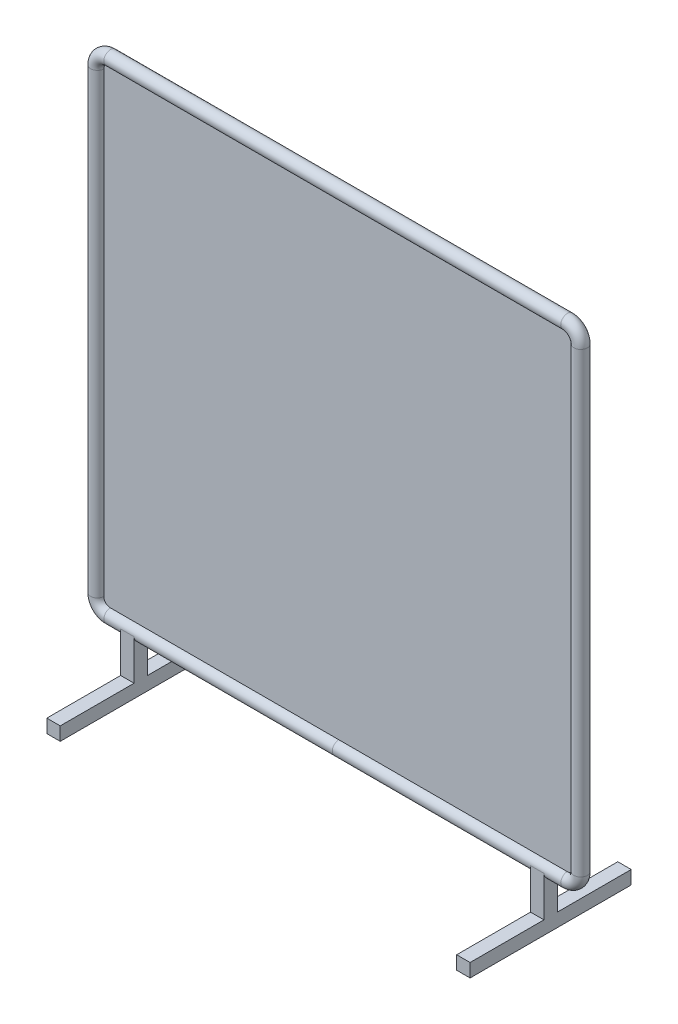
ISO-10303-21;
HEADER;
FILE_DESCRIPTION(('STEP AP214'),'2;1');
FILE_NAME('part.step','',(''),(''),'','','');
FILE_SCHEMA(('AUTOMOTIVE_DESIGN { 1 0 10303 214 1 1 1 1 }'));
ENDSEC;
DATA;
#1=APPLICATION_CONTEXT('core data for automotive mechanical design processes');
#2=APPLICATION_PROTOCOL_DEFINITION('international standard','automotive_design',2000,#1);
#3=PRODUCT_CONTEXT('',#1,'mechanical');
#4=PRODUCT('Part','Part','',(#3));
#5=PRODUCT_RELATED_PRODUCT_CATEGORY('part','',(#4));
#6=PRODUCT_DEFINITION_FORMATION('','',#4);
#7=PRODUCT_DEFINITION_CONTEXT('part definition',#1,'design');
#8=PRODUCT_DEFINITION('design','',#6,#7);
#9=PRODUCT_DEFINITION_SHAPE('','',#8);
#10=(LENGTH_UNIT() NAMED_UNIT(*) SI_UNIT(.MILLI.,.METRE.));
#11=(NAMED_UNIT(*) PLANE_ANGLE_UNIT() SI_UNIT($,.RADIAN.));
#12=(NAMED_UNIT(*) SI_UNIT($,.STERADIAN.) SOLID_ANGLE_UNIT());
#13=UNCERTAINTY_MEASURE_WITH_UNIT(LENGTH_MEASURE(1.E-05),#10,'distance_accuracy_value','');
#14=(GEOMETRIC_REPRESENTATION_CONTEXT(3) GLOBAL_UNCERTAINTY_ASSIGNED_CONTEXT((#13)) GLOBAL_UNIT_ASSIGNED_CONTEXT((#10,
#11,#12)) REPRESENTATION_CONTEXT('',''));
#15=CARTESIAN_POINT('',(0.,0.,0.));
#16=DIRECTION('',(0.,0.,1.));
#17=DIRECTION('',(1.,0.,0.));
#18=AXIS2_PLACEMENT_3D('',#15,#16,#17);
#19=CARTESIAN_POINT('',(-864.4,50.,1.));
#20=DIRECTION('',(0.,0.,-1.));
#21=DIRECTION('',(-1.,0.,0.));
#22=AXIS2_PLACEMENT_3D('',#19,#20,#21);
#23=CYLINDRICAL_SURFACE('',#22,50.);
#24=CARTESIAN_POINT('',(-864.4,50.,-1.));
#25=DIRECTION('',(0.,0.,1.));
#26=DIRECTION('',(1.,0.,0.));
#27=AXIS2_PLACEMENT_3D('',#24,#25,#26);
#28=CIRCLE('',#27,50.);
#29=CARTESIAN_POINT('',(-914.4,50.0000000000003,-1.));
#30=VERTEX_POINT('',#29);
#31=CARTESIAN_POINT('',(-864.4,0.,-1.));
#32=VERTEX_POINT('',#31);
#33=EDGE_CURVE('E151',#30,#32,#28,.T.);
#34=ORIENTED_EDGE('',*,*,#33,.T.);
#35=DIRECTION('',(0.,0.,-1.));
#36=VECTOR('',#35,1.);
#37=CARTESIAN_POINT('',(-864.4,0.,1.));
#38=LINE('',#37,#36);
#39=CARTESIAN_POINT('',(-864.4,0.,1.));
#40=VERTEX_POINT('',#39);
#41=EDGE_CURVE('E12',#40,#32,#38,.T.);
#42=ORIENTED_EDGE('',*,*,#41,.F.);
#43=CARTESIAN_POINT('',(-864.4,50.,1.));
#44=DIRECTION('',(0.,0.,1.));
#45=DIRECTION('',(1.,0.,0.));
#46=AXIS2_PLACEMENT_3D('',#43,#44,#45);
#47=CIRCLE('',#46,50.);
#48=CARTESIAN_POINT('',(-914.4,50.0000000000003,1.));
#49=VERTEX_POINT('',#48);
#50=EDGE_CURVE('E165',#49,#40,#47,.T.);
#51=ORIENTED_EDGE('',*,*,#50,.F.);
#52=DIRECTION('',(0.,0.,-1.));
#53=VECTOR('',#52,1.);
#54=CARTESIAN_POINT('',(-914.4,50.0000000000003,1.));
#55=LINE('',#54,#53);
#56=EDGE_CURVE('E147',#49,#30,#55,.T.);
#57=ORIENTED_EDGE('',*,*,#56,.T.);
#58=EDGE_LOOP('',(#34,#42,#51,#57));
#59=FACE_BOUND('',#58,.T.);
#60=ADVANCED_FACE('F55',(#59),#23,.T.);
#61=CARTESIAN_POINT('',(-864.4,0.,1.));
#62=DIRECTION('',(0.,1.,0.));
#63=DIRECTION('',(0.,0.,1.));
#64=AXIS2_PLACEMENT_3D('',#61,#62,#63);
#65=PLANE('',#64);
#66=DIRECTION('',(1.,0.,0.));
#67=VECTOR('',#66,1.);
#68=CARTESIAN_POINT('',(-864.4,0.,-1.));
#69=LINE('',#68,#67);
#70=CARTESIAN_POINT('',(864.4,0.,-1.));
#71=VERTEX_POINT('',#70);
#72=EDGE_CURVE('E154',#32,#71,#69,.T.);
#73=ORIENTED_EDGE('',*,*,#72,.T.);
#74=DIRECTION('',(0.,0.,-1.));
#75=VECTOR('',#74,1.);
#76=CARTESIAN_POINT('',(864.4,0.,1.));
#77=LINE('',#76,#75);
#78=CARTESIAN_POINT('',(864.4,0.,1.));
#79=VERTEX_POINT('',#78);
#80=EDGE_CURVE('E63',#79,#71,#77,.T.);
#81=ORIENTED_EDGE('',*,*,#80,.F.);
#82=DIRECTION('',(1.,0.,0.));
#83=VECTOR('',#82,1.);
#84=CARTESIAN_POINT('',(-864.4,0.,1.));
#85=LINE('',#84,#83);
#86=EDGE_CURVE('E114',#40,#79,#85,.T.);
#87=ORIENTED_EDGE('',*,*,#86,.F.);
#88=ORIENTED_EDGE('',*,*,#41,.T.);
#89=EDGE_LOOP('',(#73,#81,#87,#88));
#90=FACE_BOUND('',#89,.T.);
#91=ADVANCED_FACE('F200',(#90),#65,.F.);
#92=CARTESIAN_POINT('',(864.4,50.,1.));
#93=DIRECTION('',(0.,0.,-1.));
#94=DIRECTION('',(-1.,0.,0.));
#95=AXIS2_PLACEMENT_3D('',#92,#93,#94);
#96=CYLINDRICAL_SURFACE('',#95,50.);
#97=CARTESIAN_POINT('',(864.4,50.,-1.));
#98=DIRECTION('',(0.,0.,1.));
#99=DIRECTION('',(1.,0.,0.));
#100=AXIS2_PLACEMENT_3D('',#97,#98,#99);
#101=CIRCLE('',#100,50.);
#102=CARTESIAN_POINT('',(914.4,50.0000000000003,-1.));
#103=VERTEX_POINT('',#102);
#104=EDGE_CURVE('E156',#71,#103,#101,.T.);
#105=ORIENTED_EDGE('',*,*,#104,.T.);
#106=DIRECTION('',(0.,0.,-1.));
#107=VECTOR('',#106,1.);
#108=CARTESIAN_POINT('',(914.4,50.0000000000003,1.));
#109=LINE('',#108,#107);
#110=CARTESIAN_POINT('',(914.4,50.0000000000003,1.));
#111=VERTEX_POINT('',#110);
#112=EDGE_CURVE('E172',#111,#103,#109,.T.);
#113=ORIENTED_EDGE('',*,*,#112,.F.);
#114=CARTESIAN_POINT('',(864.4,50.,1.));
#115=DIRECTION('',(0.,0.,1.));
#116=DIRECTION('',(1.,0.,0.));
#117=AXIS2_PLACEMENT_3D('',#114,#115,#116);
#118=CIRCLE('',#117,50.);
#119=EDGE_CURVE('E180',#79,#111,#118,.T.);
#120=ORIENTED_EDGE('',*,*,#119,.F.);
#121=ORIENTED_EDGE('',*,*,#80,.T.);
#122=EDGE_LOOP('',(#105,#113,#120,#121));
#123=FACE_BOUND('',#122,.T.);
#124=ADVANCED_FACE('F178',(#123),#96,.T.);
#125=CARTESIAN_POINT('',(914.4,1778.8,1.));
#126=DIRECTION('',(-1.,0.,0.));
#127=DIRECTION('',(0.,0.,1.));
#128=AXIS2_PLACEMENT_3D('',#125,#126,#127);
#129=PLANE('',#128);
#130=DIRECTION('',(0.,1.,0.));
#131=VECTOR('',#130,1.);
#132=CARTESIAN_POINT('',(914.4,1778.8,-1.));
#133=LINE('',#132,#131);
#134=CARTESIAN_POINT('',(914.4,1778.8,-1.));
#135=VERTEX_POINT('',#134);
#136=EDGE_CURVE('E158',#103,#135,#133,.T.);
#137=ORIENTED_EDGE('',*,*,#136,.T.);
#138=DIRECTION('',(0.,0.,-1.));
#139=VECTOR('',#138,1.);
#140=CARTESIAN_POINT('',(914.4,1778.8,1.));
#141=LINE('',#140,#139);
#142=CARTESIAN_POINT('',(914.4,1778.8,1.));
#143=VERTEX_POINT('',#142);
#144=EDGE_CURVE('E169',#143,#135,#141,.T.);
#145=ORIENTED_EDGE('',*,*,#144,.F.);
#146=DIRECTION('',(0.,1.,0.));
#147=VECTOR('',#146,1.);
#148=CARTESIAN_POINT('',(914.4,1778.8,1.));
#149=LINE('',#148,#147);
#150=EDGE_CURVE('E192',#111,#143,#149,.T.);
#151=ORIENTED_EDGE('',*,*,#150,.F.);
#152=ORIENTED_EDGE('',*,*,#112,.T.);
#153=EDGE_LOOP('',(#137,#145,#151,#152));
#154=FACE_BOUND('',#153,.T.);
#155=ADVANCED_FACE('F188',(#154),#129,.F.);
#156=CARTESIAN_POINT('',(864.4,1778.8,1.));
#157=DIRECTION('',(0.,0.,-1.));
#158=DIRECTION('',(-1.,0.,0.));
#159=AXIS2_PLACEMENT_3D('',#156,#157,#158);
#160=CYLINDRICAL_SURFACE('',#159,50.);
#161=CARTESIAN_POINT('',(864.4,1778.8,-1.));
#162=DIRECTION('',(0.,0.,1.));
#163=DIRECTION('',(-1.,0.,0.));
#164=AXIS2_PLACEMENT_3D('',#161,#162,#163);
#165=CIRCLE('',#164,50.);
#166=CARTESIAN_POINT('',(864.4,1828.8,-1.));
#167=VERTEX_POINT('',#166);
#168=EDGE_CURVE('E160',#135,#167,#165,.T.);
#169=ORIENTED_EDGE('',*,*,#168,.T.);
#170=DIRECTION('',(0.,0.,-1.));
#171=VECTOR('',#170,1.);
#172=CARTESIAN_POINT('',(864.4,1828.8,1.));
#173=LINE('',#172,#171);
#174=CARTESIAN_POINT('',(864.4,1828.8,1.));
#175=VERTEX_POINT('',#174);
#176=EDGE_CURVE('E142',#175,#167,#173,.T.);
#177=ORIENTED_EDGE('',*,*,#176,.F.);
#178=CARTESIAN_POINT('',(864.4,1778.8,1.));
#179=DIRECTION('',(0.,0.,1.));
#180=DIRECTION('',(-1.,0.,0.));
#181=AXIS2_PLACEMENT_3D('',#178,#179,#180);
#182=CIRCLE('',#181,50.);
#183=EDGE_CURVE('E133',#143,#175,#182,.T.);
#184=ORIENTED_EDGE('',*,*,#183,.F.);
#185=ORIENTED_EDGE('',*,*,#144,.T.);
#186=EDGE_LOOP('',(#169,#177,#184,#185));
#187=FACE_BOUND('',#186,.T.);
#188=ADVANCED_FACE('F191',(#187),#160,.T.);
#189=CARTESIAN_POINT('',(-864.4,1828.8,1.));
#190=DIRECTION('',(0.,-1.,0.));
#191=DIRECTION('',(0.,0.,-1.));
#192=AXIS2_PLACEMENT_3D('',#189,#190,#191);
#193=PLANE('',#192);
#194=DIRECTION('',(-1.,0.,0.));
#195=VECTOR('',#194,1.);
#196=CARTESIAN_POINT('',(-864.4,1828.8,-1.));
#197=LINE('',#196,#195);
#198=CARTESIAN_POINT('',(-864.4,1828.8,-1.));
#199=VERTEX_POINT('',#198);
#200=EDGE_CURVE('E141',#167,#199,#197,.T.);
#201=ORIENTED_EDGE('',*,*,#200,.T.);
#202=DIRECTION('',(0.,0.,-1.));
#203=VECTOR('',#202,1.);
#204=CARTESIAN_POINT('',(-864.4,1828.8,1.));
#205=LINE('',#204,#203);
#206=CARTESIAN_POINT('',(-864.4,1828.8,1.));
#207=VERTEX_POINT('',#206);
#208=EDGE_CURVE('E138',#207,#199,#205,.T.);
#209=ORIENTED_EDGE('',*,*,#208,.F.);
#210=DIRECTION('',(-1.,0.,0.));
#211=VECTOR('',#210,1.);
#212=CARTESIAN_POINT('',(-864.4,1828.8,1.));
#213=LINE('',#212,#211);
#214=EDGE_CURVE('E127',#175,#207,#213,.T.);
#215=ORIENTED_EDGE('',*,*,#214,.F.);
#216=ORIENTED_EDGE('',*,*,#176,.T.);
#217=EDGE_LOOP('',(#201,#209,#215,#216));
#218=FACE_BOUND('',#217,.T.);
#219=ADVANCED_FACE('F139',(#218),#193,.F.);
#220=CARTESIAN_POINT('',(-864.4,1778.8,1.));
#221=DIRECTION('',(0.,0.,-1.));
#222=DIRECTION('',(-1.,0.,0.));
#223=AXIS2_PLACEMENT_3D('',#220,#221,#222);
#224=CYLINDRICAL_SURFACE('',#223,50.);
#225=CARTESIAN_POINT('',(-864.4,1778.8,-1.));
#226=DIRECTION('',(0.,0.,1.));
#227=DIRECTION('',(1.,0.,0.));
#228=AXIS2_PLACEMENT_3D('',#225,#226,#227);
#229=CIRCLE('',#228,50.);
#230=CARTESIAN_POINT('',(-914.4,1778.8,-1.));
#231=VERTEX_POINT('',#230);
#232=EDGE_CURVE('E100',#199,#231,#229,.T.);
#233=ORIENTED_EDGE('',*,*,#232,.T.);
#234=DIRECTION('',(0.,0.,-1.));
#235=VECTOR('',#234,1.);
#236=CARTESIAN_POINT('',(-914.4,1778.8,1.));
#237=LINE('',#236,#235);
#238=CARTESIAN_POINT('',(-914.4,1778.8,1.));
#239=VERTEX_POINT('',#238);
#240=EDGE_CURVE('E143',#239,#231,#237,.T.);
#241=ORIENTED_EDGE('',*,*,#240,.F.);
#242=CARTESIAN_POINT('',(-864.4,1778.8,1.));
#243=DIRECTION('',(0.,0.,1.));
#244=DIRECTION('',(1.,0.,0.));
#245=AXIS2_PLACEMENT_3D('',#242,#243,#244);
#246=CIRCLE('',#245,50.);
#247=EDGE_CURVE('E131',#207,#239,#246,.T.);
#248=ORIENTED_EDGE('',*,*,#247,.F.);
#249=ORIENTED_EDGE('',*,*,#208,.T.);
#250=EDGE_LOOP('',(#233,#241,#248,#249));
#251=FACE_BOUND('',#250,.T.);
#252=ADVANCED_FACE('F145',(#251),#224,.T.);
#253=CARTESIAN_POINT('',(-914.4,1778.8,1.));
#254=DIRECTION('',(1.,0.,0.));
#255=DIRECTION('',(0.,0.,-1.));
#256=AXIS2_PLACEMENT_3D('',#253,#254,#255);
#257=PLANE('',#256);
#258=DIRECTION('',(0.,-1.,0.));
#259=VECTOR('',#258,1.);
#260=CARTESIAN_POINT('',(-914.4,1778.8,-1.));
#261=LINE('',#260,#259);
#262=EDGE_CURVE('E106',#231,#30,#261,.T.);
#263=ORIENTED_EDGE('',*,*,#262,.T.);
#264=ORIENTED_EDGE('',*,*,#56,.F.);
#265=DIRECTION('',(0.,-1.,0.));
#266=VECTOR('',#265,1.);
#267=CARTESIAN_POINT('',(-914.4,1778.8,1.));
#268=LINE('',#267,#266);
#269=EDGE_CURVE('E71',#239,#49,#268,.T.);
#270=ORIENTED_EDGE('',*,*,#269,.F.);
#271=ORIENTED_EDGE('',*,*,#240,.T.);
#272=EDGE_LOOP('',(#263,#264,#270,#271));
#273=FACE_BOUND('',#272,.T.);
#274=ADVANCED_FACE('F216',(#273),#257,.F.);
#275=CARTESIAN_POINT('',(-864.4,50.,1.));
#276=DIRECTION('',(0.,0.,1.));
#277=DIRECTION('',(1.,0.,0.));
#278=AXIS2_PLACEMENT_3D('',#275,#276,#277);
#279=PLANE('',#278);
#280=ORIENTED_EDGE('',*,*,#50,.T.);
#281=ORIENTED_EDGE('',*,*,#86,.T.);
#282=ORIENTED_EDGE('',*,*,#119,.T.);
#283=ORIENTED_EDGE('',*,*,#150,.T.);
#284=ORIENTED_EDGE('',*,*,#183,.T.);
#285=ORIENTED_EDGE('',*,*,#214,.T.);
#286=ORIENTED_EDGE('',*,*,#247,.T.);
#287=ORIENTED_EDGE('',*,*,#269,.T.);
#288=EDGE_LOOP('',(#280,#281,#282,#283,#284,#285,#286,#287));
#289=FACE_BOUND('',#288,.T.);
#290=ADVANCED_FACE('F129',(#289),#279,.T.);
#291=CARTESIAN_POINT('',(-864.4,50.,-1.));
#292=DIRECTION('',(0.,0.,1.));
#293=DIRECTION('',(1.,0.,0.));
#294=AXIS2_PLACEMENT_3D('',#291,#292,#293);
#295=PLANE('',#294);
#296=ORIENTED_EDGE('',*,*,#33,.F.);
#297=ORIENTED_EDGE('',*,*,#262,.F.);
#298=ORIENTED_EDGE('',*,*,#232,.F.);
#299=ORIENTED_EDGE('',*,*,#200,.F.);
#300=ORIENTED_EDGE('',*,*,#168,.F.);
#301=ORIENTED_EDGE('',*,*,#136,.F.);
#302=ORIENTED_EDGE('',*,*,#104,.F.);
#303=ORIENTED_EDGE('',*,*,#72,.F.);
#304=EDGE_LOOP('',(#296,#297,#298,#299,#300,#301,#302,#303));
#305=FACE_BOUND('',#304,.T.);
#306=ADVANCED_FACE('F184',(#305),#295,.F.);
#307=CLOSED_SHELL('',(#60,#91,#124,#155,#188,#219,#252,#274,#290,#306));
#308=MANIFOLD_SOLID_BREP('B2',#307);
#309=CARTESIAN_POINT('',(0.,0.,0.));
#310=DIRECTION('',(-1.,0.,0.));
#311=DIRECTION('',(0.,0.,1.));
#312=AXIS2_PLACEMENT_3D('',#309,#310,#311);
#313=CYLINDRICAL_SURFACE('',#312,25.4);
#314=CARTESIAN_POINT('',(0.,0.,0.));
#315=DIRECTION('',(1.,0.,0.));
#316=DIRECTION('',(0.,0.,-1.));
#317=AXIS2_PLACEMENT_3D('',#314,#315,#316);
#318=CIRCLE('',#317,25.4);
#319=CARTESIAN_POINT('',(0.,0.,-25.4));
#320=VERTEX_POINT('',#319);
#321=EDGE_CURVE('E473',#320,#320,#318,.T.);
#322=ORIENTED_EDGE('',*,*,#321,.F.);
#323=EDGE_LOOP('',(#322));
#324=FACE_BOUND('',#323,.T.);
#325=CARTESIAN_POINT('',(-864.4,0.,0.));
#326=DIRECTION('',(1.,0.,0.));
#327=DIRECTION('',(0.,0.,-1.));
#328=AXIS2_PLACEMENT_3D('',#325,#326,#327);
#329=CIRCLE('',#328,25.4);
#330=CARTESIAN_POINT('',(-864.399999999999,-25.4,0.));
#331=VERTEX_POINT('',#330);
#332=EDGE_CURVE('E476',#331,#331,#329,.T.);
#333=ORIENTED_EDGE('',*,*,#332,.T.);
#334=EDGE_LOOP('',(#333));
#335=FACE_BOUND('',#334,.T.);
#336=CARTESIAN_POINT('',(-800.8,0.,0.));
#337=DIRECTION('',(1.,0.,0.));
#338=DIRECTION('',(0.,0.,-1.));
#339=AXIS2_PLACEMENT_3D('',#336,#337,#338);
#340=CIRCLE('',#339,25.4);
#341=CARTESIAN_POINT('',(-800.8,0.,25.4));
#342=VERTEX_POINT('',#341);
#343=CARTESIAN_POINT('',(-800.8,0.,-25.4));
#344=VERTEX_POINT('',#343);
#345=EDGE_CURVE('E53',#342,#344,#340,.T.);
#346=ORIENTED_EDGE('',*,*,#345,.F.);
#347=DIRECTION('',(1.,0.,0.));
#348=VECTOR('',#347,1.);
#349=CARTESIAN_POINT('',(-800.8,0.,25.4));
#350=LINE('',#349,#348);
#351=CARTESIAN_POINT('',(-750.,0.,25.4));
#352=VERTEX_POINT('',#351);
#353=EDGE_CURVE('E771',#342,#352,#350,.T.);
#354=ORIENTED_EDGE('',*,*,#353,.T.);
#355=CARTESIAN_POINT('',(-750.,0.,0.));
#356=DIRECTION('',(1.,0.,0.));
#357=DIRECTION('',(0.,0.,-1.));
#358=AXIS2_PLACEMENT_3D('',#355,#356,#357);
#359=CIRCLE('',#358,25.4);
#360=CARTESIAN_POINT('',(-750.,0.,-25.4));
#361=VERTEX_POINT('',#360);
#362=EDGE_CURVE('E291',#352,#361,#359,.T.);
#363=ORIENTED_EDGE('',*,*,#362,.T.);
#364=DIRECTION('',(1.,0.,0.));
#365=VECTOR('',#364,1.);
#366=CARTESIAN_POINT('',(-800.8,0.,-25.4));
#367=LINE('',#366,#365);
#368=EDGE_CURVE('E411',#344,#361,#367,.T.);
#369=ORIENTED_EDGE('',*,*,#368,.F.);
#370=EDGE_LOOP('',(#346,#354,#363,#369));
#371=FACE_BOUND('',#370,.T.);
#372=ADVANCED_FACE('F283',(#324,#335,#371),#313,.T.);
#373=CARTESIAN_POINT('',(864.4,0.,0.));
#374=DIRECTION('',(-1.,0.,0.));
#375=DIRECTION('',(0.,0.,1.));
#376=AXIS2_PLACEMENT_3D('',#373,#374,#375);
#377=CYLINDRICAL_SURFACE('',#376,25.4);
#378=CARTESIAN_POINT('',(864.4,0.,0.));
#379=DIRECTION('',(1.,0.,0.));
#380=DIRECTION('',(0.,0.,-1.));
#381=AXIS2_PLACEMENT_3D('',#378,#379,#380);
#382=CIRCLE('',#381,25.4);
#383=CARTESIAN_POINT('',(864.399999999999,-25.4,0.));
#384=VERTEX_POINT('',#383);
#385=EDGE_CURVE('E497',#384,#384,#382,.T.);
#386=ORIENTED_EDGE('',*,*,#385,.F.);
#387=EDGE_LOOP('',(#386));
#388=FACE_BOUND('',#387,.T.);
#389=ORIENTED_EDGE('',*,*,#321,.T.);
#390=EDGE_LOOP('',(#389));
#391=FACE_BOUND('',#390,.T.);
#392=CARTESIAN_POINT('',(800.8,0.,0.));
#393=DIRECTION('',(-1.,0.,0.));
#394=DIRECTION('',(0.,0.,1.));
#395=AXIS2_PLACEMENT_3D('',#392,#393,#394);
#396=CIRCLE('',#395,25.4);
#397=CARTESIAN_POINT('',(800.8,0.,-25.4));
#398=VERTEX_POINT('',#397);
#399=CARTESIAN_POINT('',(800.8,0.,25.4));
#400=VERTEX_POINT('',#399);
#401=EDGE_CURVE('E503',#398,#400,#396,.T.);
#402=ORIENTED_EDGE('',*,*,#401,.F.);
#403=DIRECTION('',(-1.,0.,0.));
#404=VECTOR('',#403,1.);
#405=CARTESIAN_POINT('',(800.8,0.,-25.4));
#406=LINE('',#405,#404);
#407=CARTESIAN_POINT('',(750.,0.,-25.4));
#408=VERTEX_POINT('',#407);
#409=EDGE_CURVE('E439',#398,#408,#406,.T.);
#410=ORIENTED_EDGE('',*,*,#409,.T.);
#411=CARTESIAN_POINT('',(750.,0.,0.));
#412=DIRECTION('',(-1.,0.,0.));
#413=DIRECTION('',(0.,0.,1.));
#414=AXIS2_PLACEMENT_3D('',#411,#412,#413);
#415=CIRCLE('',#414,25.4);
#416=CARTESIAN_POINT('',(750.,0.,25.4));
#417=VERTEX_POINT('',#416);
#418=EDGE_CURVE('E500',#408,#417,#415,.T.);
#419=ORIENTED_EDGE('',*,*,#418,.T.);
#420=DIRECTION('',(-1.,0.,0.));
#421=VECTOR('',#420,1.);
#422=CARTESIAN_POINT('',(800.8,0.,25.4));
#423=LINE('',#422,#421);
#424=EDGE_CURVE('E306',#400,#417,#423,.T.);
#425=ORIENTED_EDGE('',*,*,#424,.F.);
#426=EDGE_LOOP('',(#402,#410,#419,#425));
#427=FACE_BOUND('',#426,.T.);
#428=ADVANCED_FACE('F285',(#388,#391,#427),#377,.T.);
#429=CARTESIAN_POINT('',(-864.4,50.,0.));
#430=DIRECTION('',(0.,0.,-1.));
#431=DIRECTION('',(-1.,0.,0.));
#432=AXIS2_PLACEMENT_3D('',#429,#430,#431);
#433=TOROIDAL_SURFACE('',#432,50.,25.4);
#434=CARTESIAN_POINT('',(-914.4,50.0000000000003,0.));
#435=DIRECTION('',(0.,-1.,0.));
#436=DIRECTION('',(0.,0.,-1.));
#437=AXIS2_PLACEMENT_3D('',#434,#435,#436);
#438=CIRCLE('',#437,25.4);
#439=CARTESIAN_POINT('',(-939.8,50.0000000000004,0.));
#440=VERTEX_POINT('',#439);
#441=EDGE_CURVE('E479',#440,#440,#438,.T.);
#442=CARTESIAN_POINT('',(-864.4,50.,0.));
#443=DIRECTION('',(0.,0.,-1.));
#444=DIRECTION('',(-1.,0.,0.));
#445=AXIS2_PLACEMENT_3D('',#442,#443,#444);
#446=CIRCLE('',#445,75.4);
#447=EDGE_CURVE('',#331,#440,#446,.T.);
#448=ORIENTED_EDGE('',*,*,#332,.F.);
#449=ORIENTED_EDGE('',*,*,#441,.T.);
#450=ORIENTED_EDGE('',*,*,#447,.T.);
#451=ORIENTED_EDGE('',*,*,#447,.F.);
#452=EDGE_LOOP('',(#448,#450,#449,#451));
#453=FACE_BOUND('',#452,.T.);
#454=ADVANCED_FACE('F559',(#453),#433,.T.);
#455=CARTESIAN_POINT('',(-914.4,50.0000000000003,0.));
#456=DIRECTION('',(0.,1.,0.));
#457=DIRECTION('',(0.,0.,1.));
#458=AXIS2_PLACEMENT_3D('',#455,#456,#457);
#459=CYLINDRICAL_SURFACE('',#458,25.4);
#460=CARTESIAN_POINT('',(-914.4,1778.8,0.));
#461=DIRECTION('',(0.,-1.,0.));
#462=DIRECTION('',(0.,0.,-1.));
#463=AXIS2_PLACEMENT_3D('',#460,#461,#462);
#464=CIRCLE('',#463,25.4);
#465=CARTESIAN_POINT('',(-939.8,1778.8,0.));
#466=VERTEX_POINT('',#465);
#467=EDGE_CURVE('E482',#466,#466,#464,.T.);
#468=ORIENTED_EDGE('',*,*,#467,.T.);
#469=EDGE_LOOP('',(#468));
#470=FACE_BOUND('',#469,.T.);
#471=ORIENTED_EDGE('',*,*,#441,.F.);
#472=EDGE_LOOP('',(#471));
#473=FACE_BOUND('',#472,.T.);
#474=ADVANCED_FACE('F566',(#470,#473),#459,.T.);
#475=CARTESIAN_POINT('',(-864.4,1778.8,0.));
#476=DIRECTION('',(0.,0.,-1.));
#477=DIRECTION('',(-1.,0.,0.));
#478=AXIS2_PLACEMENT_3D('',#475,#476,#477);
#479=TOROIDAL_SURFACE('',#478,50.,25.4);
#480=CARTESIAN_POINT('',(-864.4,1828.8,0.));
#481=DIRECTION('',(-1.,0.,0.));
#482=DIRECTION('',(0.,0.,-1.));
#483=AXIS2_PLACEMENT_3D('',#480,#481,#482);
#484=CIRCLE('',#483,25.4);
#485=CARTESIAN_POINT('',(-864.399999999999,1854.2,0.));
#486=VERTEX_POINT('',#485);
#487=EDGE_CURVE('E485',#486,#486,#484,.T.);
#488=CARTESIAN_POINT('',(-864.4,1778.8,0.));
#489=DIRECTION('',(0.,0.,-1.));
#490=DIRECTION('',(-1.,0.,0.));
#491=AXIS2_PLACEMENT_3D('',#488,#489,#490);
#492=CIRCLE('',#491,75.4);
#493=EDGE_CURVE('',#466,#486,#492,.T.);
#494=ORIENTED_EDGE('',*,*,#467,.F.);
#495=ORIENTED_EDGE('',*,*,#487,.T.);
#496=ORIENTED_EDGE('',*,*,#493,.T.);
#497=ORIENTED_EDGE('',*,*,#493,.F.);
#498=EDGE_LOOP('',(#494,#496,#495,#497));
#499=FACE_BOUND('',#498,.T.);
#500=ADVANCED_FACE('F570',(#499),#479,.T.);
#501=CARTESIAN_POINT('',(-864.4,1828.8,0.));
#502=DIRECTION('',(1.,0.,0.));
#503=DIRECTION('',(0.,0.,-1.));
#504=AXIS2_PLACEMENT_3D('',#501,#502,#503);
#505=CYLINDRICAL_SURFACE('',#504,25.4);
#506=CARTESIAN_POINT('',(864.4,1828.8,0.));
#507=DIRECTION('',(-1.,0.,0.));
#508=DIRECTION('',(0.,0.,-1.));
#509=AXIS2_PLACEMENT_3D('',#506,#507,#508);
#510=CIRCLE('',#509,25.4);
#511=CARTESIAN_POINT('',(864.399999999999,1854.2,0.));
#512=VERTEX_POINT('',#511);
#513=EDGE_CURVE('E488',#512,#512,#510,.T.);
#514=ORIENTED_EDGE('',*,*,#513,.T.);
#515=EDGE_LOOP('',(#514));
#516=FACE_BOUND('',#515,.T.);
#517=ORIENTED_EDGE('',*,*,#487,.F.);
#518=EDGE_LOOP('',(#517));
#519=FACE_BOUND('',#518,.T.);
#520=ADVANCED_FACE('F574',(#516,#519),#505,.T.);
#521=CARTESIAN_POINT('',(864.4,1778.8,0.));
#522=DIRECTION('',(0.,0.,-1.));
#523=DIRECTION('',(-1.,0.,0.));
#524=AXIS2_PLACEMENT_3D('',#521,#522,#523);
#525=TOROIDAL_SURFACE('',#524,50.,25.4);
#526=CARTESIAN_POINT('',(914.4,1778.8,0.));
#527=DIRECTION('',(0.,1.,0.));
#528=DIRECTION('',(0.,0.,-1.));
#529=AXIS2_PLACEMENT_3D('',#526,#527,#528);
#530=CIRCLE('',#529,25.4);
#531=CARTESIAN_POINT('',(939.8,1778.8,0.));
#532=VERTEX_POINT('',#531);
#533=EDGE_CURVE('E491',#532,#532,#530,.T.);
#534=CARTESIAN_POINT('',(864.4,1778.8,0.));
#535=DIRECTION('',(0.,0.,-1.));
#536=DIRECTION('',(-1.,0.,0.));
#537=AXIS2_PLACEMENT_3D('',#534,#535,#536);
#538=CIRCLE('',#537,75.4);
#539=EDGE_CURVE('',#512,#532,#538,.T.);
#540=ORIENTED_EDGE('',*,*,#513,.F.);
#541=ORIENTED_EDGE('',*,*,#533,.T.);
#542=ORIENTED_EDGE('',*,*,#539,.T.);
#543=ORIENTED_EDGE('',*,*,#539,.F.);
#544=EDGE_LOOP('',(#540,#542,#541,#543));
#545=FACE_BOUND('',#544,.T.);
#546=ADVANCED_FACE('F578',(#545),#525,.T.);
#547=CARTESIAN_POINT('',(914.4,1778.8,0.));
#548=DIRECTION('',(0.,-1.,0.));
#549=DIRECTION('',(0.,0.,-1.));
#550=AXIS2_PLACEMENT_3D('',#547,#548,#549);
#551=CYLINDRICAL_SURFACE('',#550,25.4);
#552=CARTESIAN_POINT('',(914.4,50.,0.));
#553=DIRECTION('',(0.,1.,0.));
#554=DIRECTION('',(0.,0.,-1.));
#555=AXIS2_PLACEMENT_3D('',#552,#553,#554);
#556=CIRCLE('',#555,25.4);
#557=CARTESIAN_POINT('',(939.8,50.0000000000001,0.));
#558=VERTEX_POINT('',#557);
#559=EDGE_CURVE('E494',#558,#558,#556,.T.);
#560=ORIENTED_EDGE('',*,*,#559,.T.);
#561=EDGE_LOOP('',(#560));
#562=FACE_BOUND('',#561,.T.);
#563=ORIENTED_EDGE('',*,*,#533,.F.);
#564=EDGE_LOOP('',(#563));
#565=FACE_BOUND('',#564,.T.);
#566=ADVANCED_FACE('F582',(#562,#565),#551,.T.);
#567=CARTESIAN_POINT('',(864.4,50.,0.));
#568=DIRECTION('',(0.,0.,-1.));
#569=DIRECTION('',(-1.,0.,0.));
#570=AXIS2_PLACEMENT_3D('',#567,#568,#569);
#571=TOROIDAL_SURFACE('',#570,50.,25.4);
#572=CARTESIAN_POINT('',(864.4,50.,0.));
#573=DIRECTION('',(0.,0.,-1.));
#574=DIRECTION('',(-1.,0.,0.));
#575=AXIS2_PLACEMENT_3D('',#572,#573,#574);
#576=CIRCLE('',#575,75.4);
#577=EDGE_CURVE('',#558,#384,#576,.T.);
#578=ORIENTED_EDGE('',*,*,#559,.F.);
#579=ORIENTED_EDGE('',*,*,#385,.T.);
#580=ORIENTED_EDGE('',*,*,#577,.T.);
#581=ORIENTED_EDGE('',*,*,#577,.F.);
#582=EDGE_LOOP('',(#578,#580,#579,#581));
#583=FACE_BOUND('',#582,.T.);
#584=ADVANCED_FACE('F549',(#583),#571,.T.);
#585=CARTESIAN_POINT('',(800.8,0.,25.4));
#586=DIRECTION('',(0.,0.,-1.));
#587=DIRECTION('',(0.,1.,0.));
#588=AXIS2_PLACEMENT_3D('',#585,#586,#587);
#589=PLANE('',#588);
#590=DIRECTION('',(0.,-1.,0.));
#591=VECTOR('',#590,1.);
#592=CARTESIAN_POINT('',(750.,0.,25.4));
#593=LINE('',#592,#591);
#594=CARTESIAN_POINT('',(750.,-152.4,25.4));
#595=VERTEX_POINT('',#594);
#596=EDGE_CURVE('E417',#417,#595,#593,.T.);
#597=ORIENTED_EDGE('',*,*,#596,.T.);
#598=DIRECTION('',(-1.,0.,0.));
#599=VECTOR('',#598,1.);
#600=CARTESIAN_POINT('',(800.8,-152.4,25.4));
#601=LINE('',#600,#599);
#602=CARTESIAN_POINT('',(800.8,-152.4,25.4));
#603=VERTEX_POINT('',#602);
#604=EDGE_CURVE('E469',#603,#595,#601,.T.);
#605=ORIENTED_EDGE('',*,*,#604,.F.);
#606=DIRECTION('',(0.,-1.,0.));
#607=VECTOR('',#606,1.);
#608=CARTESIAN_POINT('',(800.8,0.,25.4));
#609=LINE('',#608,#607);
#610=EDGE_CURVE('E425',#400,#603,#609,.T.);
#611=ORIENTED_EDGE('',*,*,#610,.F.);
#612=ORIENTED_EDGE('',*,*,#424,.T.);
#613=EDGE_LOOP('',(#597,#605,#611,#612));
#614=FACE_BOUND('',#613,.T.);
#615=ADVANCED_FACE('F511',(#614),#589,.F.);
#616=CARTESIAN_POINT('',(800.8,-152.4,25.4));
#617=DIRECTION('',(0.,-1.,0.));
#618=DIRECTION('',(0.,0.,-1.));
#619=AXIS2_PLACEMENT_3D('',#616,#617,#618);
#620=PLANE('',#619);
#621=DIRECTION('',(0.,0.,1.));
#622=VECTOR('',#621,1.);
#623=CARTESIAN_POINT('',(750.,-152.4,25.4));
#624=LINE('',#623,#622);
#625=CARTESIAN_POINT('',(750.,-152.4,304.8));
#626=VERTEX_POINT('',#625);
#627=EDGE_CURVE('E419',#595,#626,#624,.T.);
#628=ORIENTED_EDGE('',*,*,#627,.T.);
#629=DIRECTION('',(-1.,0.,0.));
#630=VECTOR('',#629,1.);
#631=CARTESIAN_POINT('',(800.8,-152.4,304.8));
#632=LINE('',#631,#630);
#633=CARTESIAN_POINT('',(800.8,-152.4,304.8));
#634=VERTEX_POINT('',#633);
#635=EDGE_CURVE('E466',#634,#626,#632,.T.);
#636=ORIENTED_EDGE('',*,*,#635,.F.);
#637=DIRECTION('',(0.,0.,1.));
#638=VECTOR('',#637,1.);
#639=CARTESIAN_POINT('',(800.8,-152.4,25.4));
#640=LINE('',#639,#638);
#641=EDGE_CURVE('E427',#603,#634,#640,.T.);
#642=ORIENTED_EDGE('',*,*,#641,.F.);
#643=ORIENTED_EDGE('',*,*,#604,.T.);
#644=EDGE_LOOP('',(#628,#636,#642,#643));
#645=FACE_BOUND('',#644,.T.);
#646=ADVANCED_FACE('F541',(#645),#620,.F.);
#647=CARTESIAN_POINT('',(800.8,-152.4,304.8));
#648=DIRECTION('',(0.,0.,-1.));
#649=DIRECTION('',(-1.,0.,0.));
#650=AXIS2_PLACEMENT_3D('',#647,#648,#649);
#651=PLANE('',#650);
#652=DIRECTION('',(0.,-1.,0.));
#653=VECTOR('',#652,1.);
#654=CARTESIAN_POINT('',(750.,-152.4,304.8));
#655=LINE('',#654,#653);
#656=CARTESIAN_POINT('',(750.,-203.2,304.8));
#657=VERTEX_POINT('',#656);
#658=EDGE_CURVE('E442',#626,#657,#655,.T.);
#659=ORIENTED_EDGE('',*,*,#658,.T.);
#660=DIRECTION('',(-1.,0.,0.));
#661=VECTOR('',#660,1.);
#662=CARTESIAN_POINT('',(800.8,-203.2,304.8));
#663=LINE('',#662,#661);
#664=CARTESIAN_POINT('',(800.8,-203.2,304.8));
#665=VERTEX_POINT('',#664);
#666=EDGE_CURVE('E463',#665,#657,#663,.T.);
#667=ORIENTED_EDGE('',*,*,#666,.F.);
#668=DIRECTION('',(0.,-1.,0.));
#669=VECTOR('',#668,1.);
#670=CARTESIAN_POINT('',(800.8,-152.4,304.8));
#671=LINE('',#670,#669);
#672=EDGE_CURVE('E430',#634,#665,#671,.T.);
#673=ORIENTED_EDGE('',*,*,#672,.F.);
#674=ORIENTED_EDGE('',*,*,#635,.T.);
#675=EDGE_LOOP('',(#659,#667,#673,#674));
#676=FACE_BOUND('',#675,.T.);
#677=ADVANCED_FACE('F538',(#676),#651,.F.);
#678=CARTESIAN_POINT('',(800.8,-203.2,304.8));
#679=DIRECTION('',(0.,1.,0.));
#680=DIRECTION('',(0.,0.,1.));
#681=AXIS2_PLACEMENT_3D('',#678,#679,#680);
#682=PLANE('',#681);
#683=DIRECTION('',(0.,0.,-1.));
#684=VECTOR('',#683,1.);
#685=CARTESIAN_POINT('',(750.,-203.2,304.8));
#686=LINE('',#685,#684);
#687=CARTESIAN_POINT('',(750.,-203.2,-304.8));
#688=VERTEX_POINT('',#687);
#689=EDGE_CURVE('E444',#657,#688,#686,.T.);
#690=ORIENTED_EDGE('',*,*,#689,.T.);
#691=DIRECTION('',(-1.,0.,0.));
#692=VECTOR('',#691,1.);
#693=CARTESIAN_POINT('',(800.8,-203.2,-304.8));
#694=LINE('',#693,#692);
#695=CARTESIAN_POINT('',(800.8,-203.2,-304.8));
#696=VERTEX_POINT('',#695);
#697=EDGE_CURVE('E460',#696,#688,#694,.T.);
#698=ORIENTED_EDGE('',*,*,#697,.F.);
#699=DIRECTION('',(0.,0.,-1.));
#700=VECTOR('',#699,1.);
#701=CARTESIAN_POINT('',(800.8,-203.2,304.8));
#702=LINE('',#701,#700);
#703=EDGE_CURVE('E432',#665,#696,#702,.T.);
#704=ORIENTED_EDGE('',*,*,#703,.F.);
#705=ORIENTED_EDGE('',*,*,#666,.T.);
#706=EDGE_LOOP('',(#690,#698,#704,#705));
#707=FACE_BOUND('',#706,.T.);
#708=ADVANCED_FACE('F534',(#707),#682,.F.);
#709=CARTESIAN_POINT('',(800.8,-152.4,-304.8));
#710=DIRECTION('',(0.,0.,1.));
#711=DIRECTION('',(1.,0.,0.));
#712=AXIS2_PLACEMENT_3D('',#709,#710,#711);
#713=PLANE('',#712);
#714=DIRECTION('',(0.,1.,0.));
#715=VECTOR('',#714,1.);
#716=CARTESIAN_POINT('',(750.,-152.4,-304.8));
#717=LINE('',#716,#715);
#718=CARTESIAN_POINT('',(750.,-152.4,-304.8));
#719=VERTEX_POINT('',#718);
#720=EDGE_CURVE('E446',#688,#719,#717,.T.);
#721=ORIENTED_EDGE('',*,*,#720,.T.);
#722=DIRECTION('',(-1.,0.,0.));
#723=VECTOR('',#722,1.);
#724=CARTESIAN_POINT('',(800.8,-152.4,-304.8));
#725=LINE('',#724,#723);
#726=CARTESIAN_POINT('',(800.8,-152.4,-304.8));
#727=VERTEX_POINT('',#726);
#728=EDGE_CURVE('E457',#727,#719,#725,.T.);
#729=ORIENTED_EDGE('',*,*,#728,.F.);
#730=DIRECTION('',(0.,1.,0.));
#731=VECTOR('',#730,1.);
#732=CARTESIAN_POINT('',(800.8,-152.4,-304.8));
#733=LINE('',#732,#731);
#734=EDGE_CURVE('E434',#696,#727,#733,.T.);
#735=ORIENTED_EDGE('',*,*,#734,.F.);
#736=ORIENTED_EDGE('',*,*,#697,.T.);
#737=EDGE_LOOP('',(#721,#729,#735,#736));
#738=FACE_BOUND('',#737,.T.);
#739=ADVANCED_FACE('F529',(#738),#713,.F.);
#740=CARTESIAN_POINT('',(800.8,-152.4,-25.4));
#741=DIRECTION('',(0.,-1.,0.));
#742=DIRECTION('',(0.,0.,-1.));
#743=AXIS2_PLACEMENT_3D('',#740,#741,#742);
#744=PLANE('',#743);
#745=DIRECTION('',(0.,0.,1.));
#746=VECTOR('',#745,1.);
#747=CARTESIAN_POINT('',(750.,-152.4,-25.4));
#748=LINE('',#747,#746);
#749=CARTESIAN_POINT('',(750.,-152.4,-25.4));
#750=VERTEX_POINT('',#749);
#751=EDGE_CURVE('E448',#719,#750,#748,.T.);
#752=ORIENTED_EDGE('',*,*,#751,.T.);
#753=DIRECTION('',(-1.,0.,0.));
#754=VECTOR('',#753,1.);
#755=CARTESIAN_POINT('',(800.8,-152.4,-25.4));
#756=LINE('',#755,#754);
#757=CARTESIAN_POINT('',(800.8,-152.4,-25.4));
#758=VERTEX_POINT('',#757);
#759=EDGE_CURVE('E454',#758,#750,#756,.T.);
#760=ORIENTED_EDGE('',*,*,#759,.F.);
#761=DIRECTION('',(0.,0.,1.));
#762=VECTOR('',#761,1.);
#763=CARTESIAN_POINT('',(800.8,-152.4,-25.4));
#764=LINE('',#763,#762);
#765=EDGE_CURVE('E436',#727,#758,#764,.T.);
#766=ORIENTED_EDGE('',*,*,#765,.F.);
#767=ORIENTED_EDGE('',*,*,#728,.T.);
#768=EDGE_LOOP('',(#752,#760,#766,#767));
#769=FACE_BOUND('',#768,.T.);
#770=ADVANCED_FACE('F523',(#769),#744,.F.);
#771=CARTESIAN_POINT('',(800.8,0.,-25.4));
#772=DIRECTION('',(0.,0.,1.));
#773=DIRECTION('',(0.,-1.,0.));
#774=AXIS2_PLACEMENT_3D('',#771,#772,#773);
#775=PLANE('',#774);
#776=DIRECTION('',(0.,1.,0.));
#777=VECTOR('',#776,1.);
#778=CARTESIAN_POINT('',(750.,0.,-25.4));
#779=LINE('',#778,#777);
#780=EDGE_CURVE('E428',#750,#408,#779,.T.);
#781=ORIENTED_EDGE('',*,*,#780,.T.);
#782=ORIENTED_EDGE('',*,*,#409,.F.);
#783=DIRECTION('',(0.,1.,0.));
#784=VECTOR('',#783,1.);
#785=CARTESIAN_POINT('',(800.8,0.,-25.4));
#786=LINE('',#785,#784);
#787=EDGE_CURVE('E438',#758,#398,#786,.T.);
#788=ORIENTED_EDGE('',*,*,#787,.F.);
#789=ORIENTED_EDGE('',*,*,#759,.T.);
#790=EDGE_LOOP('',(#781,#782,#788,#789));
#791=FACE_BOUND('',#790,.T.);
#792=ADVANCED_FACE('F519',(#791),#775,.F.);
#793=CARTESIAN_POINT('',(800.8,0.,0.));
#794=DIRECTION('',(-1.,0.,0.));
#795=DIRECTION('',(0.,0.,1.));
#796=AXIS2_PLACEMENT_3D('',#793,#794,#795);
#797=PLANE('',#796);
#798=ORIENTED_EDGE('',*,*,#787,.T.);
#799=ORIENTED_EDGE('',*,*,#401,.T.);
#800=ORIENTED_EDGE('',*,*,#610,.T.);
#801=ORIENTED_EDGE('',*,*,#641,.T.);
#802=ORIENTED_EDGE('',*,*,#672,.T.);
#803=ORIENTED_EDGE('',*,*,#703,.T.);
#804=ORIENTED_EDGE('',*,*,#734,.T.);
#805=ORIENTED_EDGE('',*,*,#765,.T.);
#806=EDGE_LOOP('',(#798,#799,#800,#801,#802,#803,#804,#805));
#807=FACE_BOUND('',#806,.T.);
#808=ADVANCED_FACE('F506',(#807),#797,.F.);
#809=CARTESIAN_POINT('',(750.,0.,0.));
#810=DIRECTION('',(-1.,0.,0.));
#811=DIRECTION('',(0.,0.,1.));
#812=AXIS2_PLACEMENT_3D('',#809,#810,#811);
#813=PLANE('',#812);
#814=ORIENTED_EDGE('',*,*,#418,.F.);
#815=ORIENTED_EDGE('',*,*,#780,.F.);
#816=ORIENTED_EDGE('',*,*,#751,.F.);
#817=ORIENTED_EDGE('',*,*,#720,.F.);
#818=ORIENTED_EDGE('',*,*,#689,.F.);
#819=ORIENTED_EDGE('',*,*,#658,.F.);
#820=ORIENTED_EDGE('',*,*,#627,.F.);
#821=ORIENTED_EDGE('',*,*,#596,.F.);
#822=EDGE_LOOP('',(#814,#815,#816,#817,#818,#819,#820,#821));
#823=FACE_BOUND('',#822,.T.);
#824=ADVANCED_FACE('F515',(#823),#813,.T.);
#825=CARTESIAN_POINT('',(-800.8,0.,-25.4));
#826=DIRECTION('',(0.,0.,-1.));
#827=DIRECTION('',(0.,1.,0.));
#828=AXIS2_PLACEMENT_3D('',#825,#826,#827);
#829=PLANE('',#828);
#830=DIRECTION('',(0.,1.,0.));
#831=VECTOR('',#830,1.);
#832=CARTESIAN_POINT('',(-750.,0.,-25.4));
#833=LINE('',#832,#831);
#834=CARTESIAN_POINT('',(-750.,-152.4,-25.4));
#835=VERTEX_POINT('',#834);
#836=EDGE_CURVE('E298',#835,#361,#833,.T.);
#837=ORIENTED_EDGE('',*,*,#836,.F.);
#838=DIRECTION('',(1.,0.,0.));
#839=VECTOR('',#838,1.);
#840=CARTESIAN_POINT('',(-800.8,-152.4,-25.4));
#841=LINE('',#840,#839);
#842=CARTESIAN_POINT('',(-800.8,-152.4,-25.4));
#843=VERTEX_POINT('',#842);
#844=EDGE_CURVE('E413',#843,#835,#841,.T.);
#845=ORIENTED_EDGE('',*,*,#844,.F.);
#846=DIRECTION('',(0.,1.,0.));
#847=VECTOR('',#846,1.);
#848=CARTESIAN_POINT('',(-800.8,0.,-25.4));
#849=LINE('',#848,#847);
#850=EDGE_CURVE('E401',#843,#344,#849,.T.);
#851=ORIENTED_EDGE('',*,*,#850,.T.);
#852=ORIENTED_EDGE('',*,*,#368,.T.);
#853=EDGE_LOOP('',(#837,#845,#851,#852));
#854=FACE_BOUND('',#853,.T.);
#855=ADVANCED_FACE('F410',(#854),#829,.T.);
#856=CARTESIAN_POINT('',(-800.8,-152.4,-25.4));
#857=DIRECTION('',(0.,1.,0.));
#858=DIRECTION('',(0.,0.,1.));
#859=AXIS2_PLACEMENT_3D('',#856,#857,#858);
#860=PLANE('',#859);
#861=DIRECTION('',(0.,0.,1.));
#862=VECTOR('',#861,1.);
#863=CARTESIAN_POINT('',(-750.,-152.4,-25.4));
#864=LINE('',#863,#862);
#865=CARTESIAN_POINT('',(-750.,-152.4,-304.8));
#866=VERTEX_POINT('',#865);
#867=EDGE_CURVE('E795',#866,#835,#864,.T.);
#868=ORIENTED_EDGE('',*,*,#867,.F.);
#869=DIRECTION('',(1.,0.,0.));
#870=VECTOR('',#869,1.);
#871=CARTESIAN_POINT('',(-800.8,-152.4,-304.8));
#872=LINE('',#871,#870);
#873=CARTESIAN_POINT('',(-800.8,-152.4,-304.8));
#874=VERTEX_POINT('',#873);
#875=EDGE_CURVE('E421',#874,#866,#872,.T.);
#876=ORIENTED_EDGE('',*,*,#875,.F.);
#877=DIRECTION('',(0.,0.,1.));
#878=VECTOR('',#877,1.);
#879=CARTESIAN_POINT('',(-800.8,-152.4,-25.4));
#880=LINE('',#879,#878);
#881=EDGE_CURVE('E414',#874,#843,#880,.T.);
#882=ORIENTED_EDGE('',*,*,#881,.T.);
#883=ORIENTED_EDGE('',*,*,#844,.T.);
#884=EDGE_LOOP('',(#868,#876,#882,#883));
#885=FACE_BOUND('',#884,.T.);
#886=ADVANCED_FACE('F689',(#885),#860,.T.);
#887=CARTESIAN_POINT('',(-800.8,-152.4,-304.8));
#888=DIRECTION('',(0.,0.,-1.));
#889=DIRECTION('',(-1.,0.,0.));
#890=AXIS2_PLACEMENT_3D('',#887,#888,#889);
#891=PLANE('',#890);
#892=DIRECTION('',(0.,1.,0.));
#893=VECTOR('',#892,1.);
#894=CARTESIAN_POINT('',(-750.,-152.4,-304.8));
#895=LINE('',#894,#893);
#896=CARTESIAN_POINT('',(-750.,-203.2,-304.8));
#897=VERTEX_POINT('',#896);
#898=EDGE_CURVE('E791',#897,#866,#895,.T.);
#899=ORIENTED_EDGE('',*,*,#898,.F.);
#900=DIRECTION('',(1.,0.,0.));
#901=VECTOR('',#900,1.);
#902=CARTESIAN_POINT('',(-800.8,-203.2,-304.8));
#903=LINE('',#902,#901);
#904=CARTESIAN_POINT('',(-800.8,-203.2,-304.8));
#905=VERTEX_POINT('',#904);
#906=EDGE_CURVE('E786',#905,#897,#903,.T.);
#907=ORIENTED_EDGE('',*,*,#906,.F.);
#908=DIRECTION('',(0.,1.,0.));
#909=VECTOR('',#908,1.);
#910=CARTESIAN_POINT('',(-800.8,-152.4,-304.8));
#911=LINE('',#910,#909);
#912=EDGE_CURVE('E794',#905,#874,#911,.T.);
#913=ORIENTED_EDGE('',*,*,#912,.T.);
#914=ORIENTED_EDGE('',*,*,#875,.T.);
#915=EDGE_LOOP('',(#899,#907,#913,#914));
#916=FACE_BOUND('',#915,.T.);
#917=ADVANCED_FACE('F698',(#916),#891,.T.);
#918=CARTESIAN_POINT('',(-800.8,-203.2,304.8));
#919=DIRECTION('',(0.,-1.,0.));
#920=DIRECTION('',(0.,0.,-1.));
#921=AXIS2_PLACEMENT_3D('',#918,#919,#920);
#922=PLANE('',#921);
#923=DIRECTION('',(0.,0.,-1.));
#924=VECTOR('',#923,1.);
#925=CARTESIAN_POINT('',(-750.,-203.2,304.8));
#926=LINE('',#925,#924);
#927=CARTESIAN_POINT('',(-750.,-203.2,304.8));
#928=VERTEX_POINT('',#927);
#929=EDGE_CURVE('E799',#928,#897,#926,.T.);
#930=ORIENTED_EDGE('',*,*,#929,.F.);
#931=DIRECTION('',(1.,0.,0.));
#932=VECTOR('',#931,1.);
#933=CARTESIAN_POINT('',(-800.8,-203.2,304.8));
#934=LINE('',#933,#932);
#935=CARTESIAN_POINT('',(-800.8,-203.2,304.8));
#936=VERTEX_POINT('',#935);
#937=EDGE_CURVE('E784',#936,#928,#934,.T.);
#938=ORIENTED_EDGE('',*,*,#937,.F.);
#939=DIRECTION('',(0.,0.,-1.));
#940=VECTOR('',#939,1.);
#941=CARTESIAN_POINT('',(-800.8,-203.2,304.8));
#942=LINE('',#941,#940);
#943=EDGE_CURVE('E812',#936,#905,#942,.T.);
#944=ORIENTED_EDGE('',*,*,#943,.T.);
#945=ORIENTED_EDGE('',*,*,#906,.T.);
#946=EDGE_LOOP('',(#930,#938,#944,#945));
#947=FACE_BOUND('',#946,.T.);
#948=ADVANCED_FACE('F708',(#947),#922,.T.);
#949=CARTESIAN_POINT('',(-800.8,-152.4,304.8));
#950=DIRECTION('',(0.,0.,1.));
#951=DIRECTION('',(1.,0.,0.));
#952=AXIS2_PLACEMENT_3D('',#949,#950,#951);
#953=PLANE('',#952);
#954=DIRECTION('',(0.,-1.,0.));
#955=VECTOR('',#954,1.);
#956=CARTESIAN_POINT('',(-750.,-152.4,304.8));
#957=LINE('',#956,#955);
#958=CARTESIAN_POINT('',(-750.,-152.4,304.8));
#959=VERTEX_POINT('',#958);
#960=EDGE_CURVE('E801',#959,#928,#957,.T.);
#961=ORIENTED_EDGE('',*,*,#960,.F.);
#962=DIRECTION('',(1.,0.,0.));
#963=VECTOR('',#962,1.);
#964=CARTESIAN_POINT('',(-800.8,-152.4,304.8));
#965=LINE('',#964,#963);
#966=CARTESIAN_POINT('',(-800.8,-152.4,304.8));
#967=VERTEX_POINT('',#966);
#968=EDGE_CURVE('E777',#967,#959,#965,.T.);
#969=ORIENTED_EDGE('',*,*,#968,.F.);
#970=DIRECTION('',(0.,-1.,0.));
#971=VECTOR('',#970,1.);
#972=CARTESIAN_POINT('',(-800.8,-152.4,304.8));
#973=LINE('',#972,#971);
#974=EDGE_CURVE('E809',#967,#936,#973,.T.);
#975=ORIENTED_EDGE('',*,*,#974,.T.);
#976=ORIENTED_EDGE('',*,*,#937,.T.);
#977=EDGE_LOOP('',(#961,#969,#975,#976));
#978=FACE_BOUND('',#977,.T.);
#979=ADVANCED_FACE('F718',(#978),#953,.T.);
#980=CARTESIAN_POINT('',(-800.8,-152.4,25.4));
#981=DIRECTION('',(0.,1.,0.));
#982=DIRECTION('',(0.,0.,1.));
#983=AXIS2_PLACEMENT_3D('',#980,#981,#982);
#984=PLANE('',#983);
#985=DIRECTION('',(0.,0.,1.));
#986=VECTOR('',#985,1.);
#987=CARTESIAN_POINT('',(-750.,-152.4,25.4));
#988=LINE('',#987,#986);
#989=CARTESIAN_POINT('',(-750.,-152.4,25.4));
#990=VERTEX_POINT('',#989);
#991=EDGE_CURVE('E774',#990,#959,#988,.T.);
#992=ORIENTED_EDGE('',*,*,#991,.F.);
#993=DIRECTION('',(1.,0.,0.));
#994=VECTOR('',#993,1.);
#995=CARTESIAN_POINT('',(-800.8,-152.4,25.4));
#996=LINE('',#995,#994);
#997=CARTESIAN_POINT('',(-800.8,-152.4,25.4));
#998=VERTEX_POINT('',#997);
#999=EDGE_CURVE('E772',#998,#990,#996,.T.);
#1000=ORIENTED_EDGE('',*,*,#999,.F.);
#1001=DIRECTION('',(0.,0.,1.));
#1002=VECTOR('',#1001,1.);
#1003=CARTESIAN_POINT('',(-800.8,-152.4,25.4));
#1004=LINE('',#1003,#1002);
#1005=EDGE_CURVE('E779',#998,#967,#1004,.T.);
#1006=ORIENTED_EDGE('',*,*,#1005,.T.);
#1007=ORIENTED_EDGE('',*,*,#968,.T.);
#1008=EDGE_LOOP('',(#992,#1000,#1006,#1007));
#1009=FACE_BOUND('',#1008,.T.);
#1010=ADVANCED_FACE('F728',(#1009),#984,.T.);
#1011=CARTESIAN_POINT('',(-800.8,0.,25.4));
#1012=DIRECTION('',(0.,0.,1.));
#1013=DIRECTION('',(0.,-1.,0.));
#1014=AXIS2_PLACEMENT_3D('',#1011,#1012,#1013);
#1015=PLANE('',#1014);
#1016=DIRECTION('',(0.,-1.,0.));
#1017=VECTOR('',#1016,1.);
#1018=CARTESIAN_POINT('',(-750.,0.,25.4));
#1019=LINE('',#1018,#1017);
#1020=EDGE_CURVE('E415',#352,#990,#1019,.T.);
#1021=ORIENTED_EDGE('',*,*,#1020,.F.);
#1022=ORIENTED_EDGE('',*,*,#353,.F.);
#1023=DIRECTION('',(0.,-1.,0.));
#1024=VECTOR('',#1023,1.);
#1025=CARTESIAN_POINT('',(-800.8,0.,25.4));
#1026=LINE('',#1025,#1024);
#1027=EDGE_CURVE('E405',#342,#998,#1026,.T.);
#1028=ORIENTED_EDGE('',*,*,#1027,.T.);
#1029=ORIENTED_EDGE('',*,*,#999,.T.);
#1030=EDGE_LOOP('',(#1021,#1022,#1028,#1029));
#1031=FACE_BOUND('',#1030,.T.);
#1032=ADVANCED_FACE('F738',(#1031),#1015,.T.);
#1033=CARTESIAN_POINT('',(-800.8,0.,0.));
#1034=DIRECTION('',(1.,0.,0.));
#1035=DIRECTION('',(0.,0.,1.));
#1036=AXIS2_PLACEMENT_3D('',#1033,#1034,#1035);
#1037=PLANE('',#1036);
#1038=ORIENTED_EDGE('',*,*,#1027,.F.);
#1039=ORIENTED_EDGE('',*,*,#345,.T.);
#1040=ORIENTED_EDGE('',*,*,#850,.F.);
#1041=ORIENTED_EDGE('',*,*,#881,.F.);
#1042=ORIENTED_EDGE('',*,*,#912,.F.);
#1043=ORIENTED_EDGE('',*,*,#943,.F.);
#1044=ORIENTED_EDGE('',*,*,#974,.F.);
#1045=ORIENTED_EDGE('',*,*,#1005,.F.);
#1046=EDGE_LOOP('',(#1038,#1039,#1040,#1041,#1042,#1043,#1044,#1045));
#1047=FACE_BOUND('',#1046,.T.);
#1048=ADVANCED_FACE('F399',(#1047),#1037,.F.);
#1049=CARTESIAN_POINT('',(-750.,0.,0.));
#1050=DIRECTION('',(1.,0.,0.));
#1051=DIRECTION('',(0.,0.,1.));
#1052=AXIS2_PLACEMENT_3D('',#1049,#1050,#1051);
#1053=PLANE('',#1052);
#1054=ORIENTED_EDGE('',*,*,#362,.F.);
#1055=ORIENTED_EDGE('',*,*,#1020,.T.);
#1056=ORIENTED_EDGE('',*,*,#991,.T.);
#1057=ORIENTED_EDGE('',*,*,#960,.T.);
#1058=ORIENTED_EDGE('',*,*,#929,.T.);
#1059=ORIENTED_EDGE('',*,*,#898,.T.);
#1060=ORIENTED_EDGE('',*,*,#867,.T.);
#1061=ORIENTED_EDGE('',*,*,#836,.T.);
#1062=EDGE_LOOP('',(#1054,#1055,#1056,#1057,#1058,#1059,#1060,#1061));
#1063=FACE_BOUND('',#1062,.T.);
#1064=ADVANCED_FACE('F757',(#1063),#1053,.T.);
#1065=CLOSED_SHELL('',(#372,#428,#454,#474,#500,#520,#546,#566,#584,#615,#646,#677,#708,#739,
#770,#792,#808,#824,#855,#886,#917,#948,#979,#1010,#1032,#1048,#1064));
#1066=MANIFOLD_SOLID_BREP('B6',#1065);
#1067=ADVANCED_BREP_SHAPE_REPRESENTATION('',(#18,#308,#1066),#14);
#1068=SHAPE_DEFINITION_REPRESENTATION(#9,#1067);
ENDSEC;
END-ISO-10303-21;
